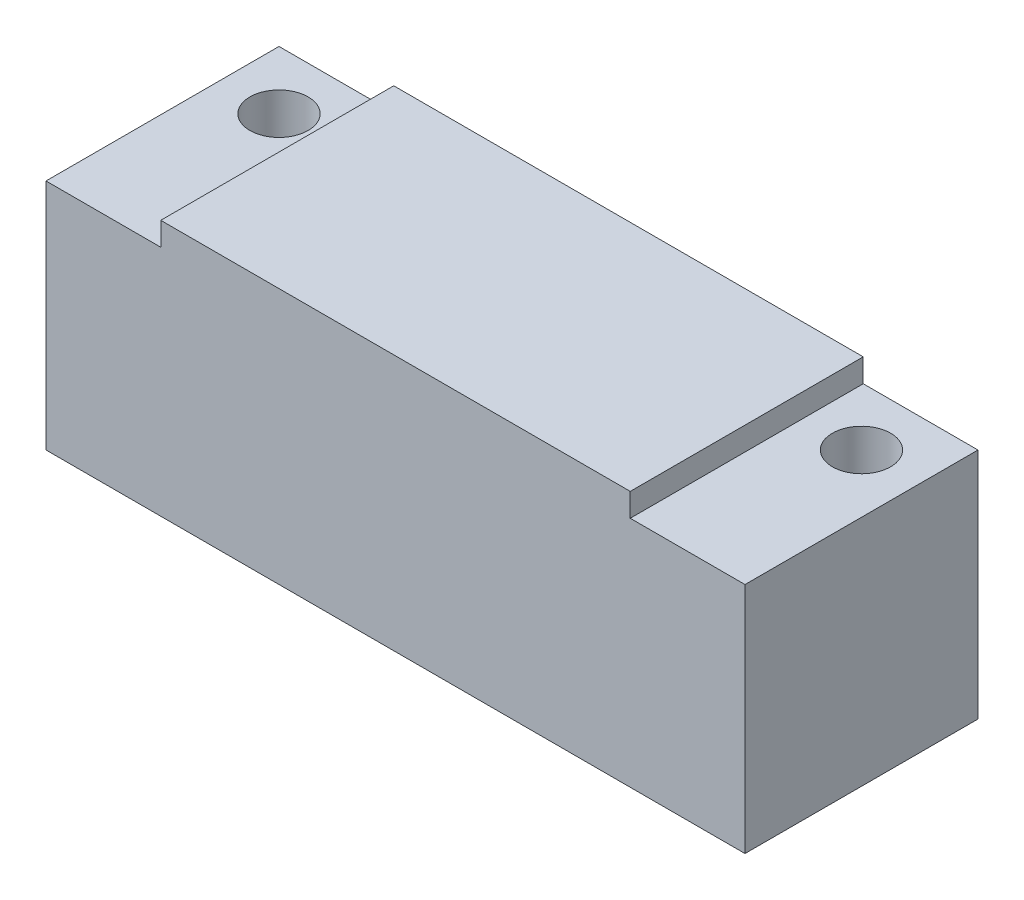
ISO-10303-21;
HEADER;
FILE_DESCRIPTION(('STEP AP214'),'2;1');
FILE_NAME('part.step','',(''),(''),'','','');
FILE_SCHEMA(('AUTOMOTIVE_DESIGN { 1 0 10303 214 1 1 1 1 }'));
ENDSEC;
DATA;
#1=APPLICATION_CONTEXT('core data for automotive mechanical design processes');
#2=APPLICATION_PROTOCOL_DEFINITION('international standard','automotive_design',2000,#1);
#3=PRODUCT_CONTEXT('',#1,'mechanical');
#4=PRODUCT('Part','Part','',(#3));
#5=PRODUCT_RELATED_PRODUCT_CATEGORY('part','',(#4));
#6=PRODUCT_DEFINITION_FORMATION('','',#4);
#7=PRODUCT_DEFINITION_CONTEXT('part definition',#1,'design');
#8=PRODUCT_DEFINITION('design','',#6,#7);
#9=PRODUCT_DEFINITION_SHAPE('','',#8);
#10=(LENGTH_UNIT() NAMED_UNIT(*) SI_UNIT(.MILLI.,.METRE.));
#11=(NAMED_UNIT(*) PLANE_ANGLE_UNIT() SI_UNIT($,.RADIAN.));
#12=(NAMED_UNIT(*) SI_UNIT($,.STERADIAN.) SOLID_ANGLE_UNIT());
#13=UNCERTAINTY_MEASURE_WITH_UNIT(LENGTH_MEASURE(1.E-05),#10,'distance_accuracy_value','');
#14=(GEOMETRIC_REPRESENTATION_CONTEXT(3) GLOBAL_UNCERTAINTY_ASSIGNED_CONTEXT((#13)) GLOBAL_UNIT_ASSIGNED_CONTEXT((#10,
#11,#12)) REPRESENTATION_CONTEXT('',''));
#15=CARTESIAN_POINT('',(0.,0.,0.));
#16=DIRECTION('',(0.,0.,1.));
#17=DIRECTION('',(1.,0.,0.));
#18=AXIS2_PLACEMENT_3D('',#15,#16,#17);
#19=CARTESIAN_POINT('',(0.,0.,20.));
#20=DIRECTION('',(1.,0.,0.));
#21=DIRECTION('',(0.,0.,-1.));
#22=AXIS2_PLACEMENT_3D('',#19,#20,#21);
#23=PLANE('',#22);
#24=DIRECTION('',(0.,-1.,0.));
#25=VECTOR('',#24,1.);
#26=CARTESIAN_POINT('',(0.,0.,0.));
#27=LINE('',#26,#25);
#28=CARTESIAN_POINT('',(0.,20.,0.));
#29=VERTEX_POINT('',#28);
#30=CARTESIAN_POINT('',(0.,0.,0.));
#31=VERTEX_POINT('',#30);
#32=EDGE_CURVE('E148',#29,#31,#27,.T.);
#33=ORIENTED_EDGE('',*,*,#32,.T.);
#34=DIRECTION('',(0.,0.,-1.));
#35=VECTOR('',#34,1.);
#36=CARTESIAN_POINT('',(0.,0.,20.));
#37=LINE('',#36,#35);
#38=CARTESIAN_POINT('',(0.,0.,20.));
#39=VERTEX_POINT('',#38);
#40=EDGE_CURVE('E11',#39,#31,#37,.T.);
#41=ORIENTED_EDGE('',*,*,#40,.F.);
#42=DIRECTION('',(0.,-1.,0.));
#43=VECTOR('',#42,1.);
#44=CARTESIAN_POINT('',(0.,0.,20.));
#45=LINE('',#44,#43);
#46=CARTESIAN_POINT('',(0.,20.,20.));
#47=VERTEX_POINT('',#46);
#48=EDGE_CURVE('E170',#47,#39,#45,.T.);
#49=ORIENTED_EDGE('',*,*,#48,.F.);
#50=DIRECTION('',(0.,0.,-1.));
#51=VECTOR('',#50,1.);
#52=CARTESIAN_POINT('',(0.,20.,20.));
#53=LINE('',#52,#51);
#54=EDGE_CURVE('E144',#47,#29,#53,.T.);
#55=ORIENTED_EDGE('',*,*,#54,.T.);
#56=EDGE_LOOP('',(#33,#41,#49,#55));
#57=FACE_BOUND('',#56,.T.);
#58=ADVANCED_FACE('F45',(#57),#23,.F.);
#59=CARTESIAN_POINT('',(0.,0.,20.));
#60=DIRECTION('',(0.,1.,0.));
#61=DIRECTION('',(0.,0.,1.));
#62=AXIS2_PLACEMENT_3D('',#59,#60,#61);
#63=PLANE('',#62);
#64=CARTESIAN_POINT('',(55.,0.,5.));
#65=DIRECTION('',(0.,-1.,0.));
#66=DIRECTION('',(0.,0.,-1.));
#67=AXIS2_PLACEMENT_3D('',#64,#65,#66);
#68=CIRCLE('',#67,2.5);
#69=CARTESIAN_POINT('',(55.,0.,2.5));
#70=VERTEX_POINT('',#69);
#71=EDGE_CURVE('E190',#70,#70,#68,.T.);
#72=ORIENTED_EDGE('',*,*,#71,.F.);
#73=EDGE_LOOP('',(#72));
#74=FACE_BOUND('',#73,.T.);
#75=CARTESIAN_POINT('',(5.,0.,5.));
#76=DIRECTION('',(0.,-1.,0.));
#77=DIRECTION('',(0.,0.,-1.));
#78=AXIS2_PLACEMENT_3D('',#75,#76,#77);
#79=CIRCLE('',#78,2.5);
#80=CARTESIAN_POINT('',(5.,0.,2.5));
#81=VERTEX_POINT('',#80);
#82=EDGE_CURVE('E197',#81,#81,#79,.T.);
#83=ORIENTED_EDGE('',*,*,#82,.F.);
#84=EDGE_LOOP('',(#83));
#85=FACE_BOUND('',#84,.T.);
#86=DIRECTION('',(1.,0.,0.));
#87=VECTOR('',#86,1.);
#88=CARTESIAN_POINT('',(0.,0.,0.));
#89=LINE('',#88,#87);
#90=CARTESIAN_POINT('',(60.,0.,0.));
#91=VERTEX_POINT('',#90);
#92=EDGE_CURVE('E152',#31,#91,#89,.T.);
#93=ORIENTED_EDGE('',*,*,#92,.T.);
#94=DIRECTION('',(0.,0.,-1.));
#95=VECTOR('',#94,1.);
#96=CARTESIAN_POINT('',(60.,0.,20.));
#97=LINE('',#96,#95);
#98=CARTESIAN_POINT('',(60.,0.,20.));
#99=VERTEX_POINT('',#98);
#100=EDGE_CURVE('E55',#99,#91,#97,.T.);
#101=ORIENTED_EDGE('',*,*,#100,.F.);
#102=DIRECTION('',(1.,0.,0.));
#103=VECTOR('',#102,1.);
#104=CARTESIAN_POINT('',(0.,0.,20.));
#105=LINE('',#104,#103);
#106=EDGE_CURVE('E107',#39,#99,#105,.T.);
#107=ORIENTED_EDGE('',*,*,#106,.F.);
#108=ORIENTED_EDGE('',*,*,#40,.T.);
#109=EDGE_LOOP('',(#93,#101,#107,#108));
#110=FACE_BOUND('',#109,.T.);
#111=ADVANCED_FACE('F245',(#74,#85,#110),#63,.F.);
#112=CARTESIAN_POINT('',(60.,0.,20.));
#113=DIRECTION('',(-1.,0.,0.));
#114=DIRECTION('',(0.,0.,1.));
#115=AXIS2_PLACEMENT_3D('',#112,#113,#114);
#116=PLANE('',#115);
#117=DIRECTION('',(0.,1.,0.));
#118=VECTOR('',#117,1.);
#119=CARTESIAN_POINT('',(60.,0.,0.));
#120=LINE('',#119,#118);
#121=CARTESIAN_POINT('',(60.,20.,0.));
#122=VERTEX_POINT('',#121);
#123=EDGE_CURVE('E155',#91,#122,#120,.T.);
#124=ORIENTED_EDGE('',*,*,#123,.T.);
#125=DIRECTION('',(0.,0.,-1.));
#126=VECTOR('',#125,1.);
#127=CARTESIAN_POINT('',(60.,20.,20.));
#128=LINE('',#127,#126);
#129=CARTESIAN_POINT('',(60.,20.,20.));
#130=VERTEX_POINT('',#129);
#131=EDGE_CURVE('E181',#130,#122,#128,.T.);
#132=ORIENTED_EDGE('',*,*,#131,.F.);
#133=DIRECTION('',(0.,1.,0.));
#134=VECTOR('',#133,1.);
#135=CARTESIAN_POINT('',(60.,0.,20.));
#136=LINE('',#135,#134);
#137=EDGE_CURVE('E209',#99,#130,#136,.T.);
#138=ORIENTED_EDGE('',*,*,#137,.F.);
#139=ORIENTED_EDGE('',*,*,#100,.T.);
#140=EDGE_LOOP('',(#124,#132,#138,#139));
#141=FACE_BOUND('',#140,.T.);
#142=ADVANCED_FACE('F250',(#141),#116,.F.);
#143=CARTESIAN_POINT('',(60.,20.,20.));
#144=DIRECTION('',(0.,-1.,0.));
#145=DIRECTION('',(0.,0.,-1.));
#146=AXIS2_PLACEMENT_3D('',#143,#144,#145);
#147=PLANE('',#146);
#148=CARTESIAN_POINT('',(55.,20.,5.));
#149=DIRECTION('',(0.,-1.,0.));
#150=DIRECTION('',(0.,0.,-1.));
#151=AXIS2_PLACEMENT_3D('',#148,#149,#150);
#152=CIRCLE('',#151,2.5);
#153=CARTESIAN_POINT('',(55.,20.,2.5));
#154=VERTEX_POINT('',#153);
#155=EDGE_CURVE('E48',#154,#154,#152,.T.);
#156=ORIENTED_EDGE('',*,*,#155,.T.);
#157=EDGE_LOOP('',(#156));
#158=FACE_BOUND('',#157,.T.);
#159=DIRECTION('',(-1.,0.,0.));
#160=VECTOR('',#159,1.);
#161=CARTESIAN_POINT('',(60.,20.,0.));
#162=LINE('',#161,#160);
#163=CARTESIAN_POINT('',(50.15,20.,0.));
#164=VERTEX_POINT('',#163);
#165=EDGE_CURVE('E158',#122,#164,#162,.T.);
#166=ORIENTED_EDGE('',*,*,#165,.T.);
#167=DIRECTION('',(0.,0.,-1.));
#168=VECTOR('',#167,1.);
#169=CARTESIAN_POINT('',(50.15,20.,20.));
#170=LINE('',#169,#168);
#171=CARTESIAN_POINT('',(50.15,20.,20.));
#172=VERTEX_POINT('',#171);
#173=EDGE_CURVE('E177',#172,#164,#170,.T.);
#174=ORIENTED_EDGE('',*,*,#173,.F.);
#175=DIRECTION('',(-1.,0.,0.));
#176=VECTOR('',#175,1.);
#177=CARTESIAN_POINT('',(60.,20.,20.));
#178=LINE('',#177,#176);
#179=EDGE_CURVE('E212',#130,#172,#178,.T.);
#180=ORIENTED_EDGE('',*,*,#179,.F.);
#181=ORIENTED_EDGE('',*,*,#131,.T.);
#182=EDGE_LOOP('',(#166,#174,#180,#181));
#183=FACE_BOUND('',#182,.T.);
#184=ADVANCED_FACE('F220',(#158,#183),#147,.F.);
#185=CARTESIAN_POINT('',(50.15,22.,20.));
#186=DIRECTION('',(-1.,0.,0.));
#187=DIRECTION('',(0.,0.,1.));
#188=AXIS2_PLACEMENT_3D('',#185,#186,#187);
#189=PLANE('',#188);
#190=DIRECTION('',(0.,1.,0.));
#191=VECTOR('',#190,1.);
#192=CARTESIAN_POINT('',(50.15,22.,0.));
#193=LINE('',#192,#191);
#194=CARTESIAN_POINT('',(50.15,22.,0.));
#195=VERTEX_POINT('',#194);
#196=EDGE_CURVE('E161',#164,#195,#193,.T.);
#197=ORIENTED_EDGE('',*,*,#196,.T.);
#198=DIRECTION('',(0.,0.,-1.));
#199=VECTOR('',#198,1.);
#200=CARTESIAN_POINT('',(50.15,22.,20.));
#201=LINE('',#200,#199);
#202=CARTESIAN_POINT('',(50.15,22.,20.));
#203=VERTEX_POINT('',#202);
#204=EDGE_CURVE('E137',#203,#195,#201,.T.);
#205=ORIENTED_EDGE('',*,*,#204,.F.);
#206=DIRECTION('',(0.,1.,0.));
#207=VECTOR('',#206,1.);
#208=CARTESIAN_POINT('',(50.15,22.,20.));
#209=LINE('',#208,#207);
#210=EDGE_CURVE('E126',#172,#203,#209,.T.);
#211=ORIENTED_EDGE('',*,*,#210,.F.);
#212=ORIENTED_EDGE('',*,*,#173,.T.);
#213=EDGE_LOOP('',(#197,#205,#211,#212));
#214=FACE_BOUND('',#213,.T.);
#215=ADVANCED_FACE('F224',(#214),#189,.F.);
#216=CARTESIAN_POINT('',(9.85,22.,20.));
#217=DIRECTION('',(0.,-1.,0.));
#218=DIRECTION('',(0.,0.,-1.));
#219=AXIS2_PLACEMENT_3D('',#216,#217,#218);
#220=PLANE('',#219);
#221=DIRECTION('',(-1.,0.,0.));
#222=VECTOR('',#221,1.);
#223=CARTESIAN_POINT('',(9.85,22.,0.));
#224=LINE('',#223,#222);
#225=CARTESIAN_POINT('',(9.85,22.,0.));
#226=VERTEX_POINT('',#225);
#227=EDGE_CURVE('E135',#195,#226,#224,.T.);
#228=ORIENTED_EDGE('',*,*,#227,.T.);
#229=DIRECTION('',(0.,0.,-1.));
#230=VECTOR('',#229,1.);
#231=CARTESIAN_POINT('',(9.85,22.,20.));
#232=LINE('',#231,#230);
#233=CARTESIAN_POINT('',(9.85,22.,20.));
#234=VERTEX_POINT('',#233);
#235=EDGE_CURVE('E132',#234,#226,#232,.T.);
#236=ORIENTED_EDGE('',*,*,#235,.F.);
#237=DIRECTION('',(-1.,0.,0.));
#238=VECTOR('',#237,1.);
#239=CARTESIAN_POINT('',(9.85,22.,20.));
#240=LINE('',#239,#238);
#241=EDGE_CURVE('E120',#203,#234,#240,.T.);
#242=ORIENTED_EDGE('',*,*,#241,.F.);
#243=ORIENTED_EDGE('',*,*,#204,.T.);
#244=EDGE_LOOP('',(#228,#236,#242,#243));
#245=FACE_BOUND('',#244,.T.);
#246=ADVANCED_FACE('F133',(#245),#220,.F.);
#247=CARTESIAN_POINT('',(9.85,22.,20.));
#248=DIRECTION('',(1.,0.,0.));
#249=DIRECTION('',(0.,0.,-1.));
#250=AXIS2_PLACEMENT_3D('',#247,#248,#249);
#251=PLANE('',#250);
#252=DIRECTION('',(0.,-1.,0.));
#253=VECTOR('',#252,1.);
#254=CARTESIAN_POINT('',(9.85,22.,0.));
#255=LINE('',#254,#253);
#256=CARTESIAN_POINT('',(9.85,20.,0.));
#257=VERTEX_POINT('',#256);
#258=EDGE_CURVE('E93',#226,#257,#255,.T.);
#259=ORIENTED_EDGE('',*,*,#258,.T.);
#260=DIRECTION('',(0.,0.,-1.));
#261=VECTOR('',#260,1.);
#262=CARTESIAN_POINT('',(9.85,20.,20.));
#263=LINE('',#262,#261);
#264=CARTESIAN_POINT('',(9.85,20.,20.));
#265=VERTEX_POINT('',#264);
#266=EDGE_CURVE('E138',#265,#257,#263,.T.);
#267=ORIENTED_EDGE('',*,*,#266,.F.);
#268=DIRECTION('',(0.,-1.,0.));
#269=VECTOR('',#268,1.);
#270=CARTESIAN_POINT('',(9.85,22.,20.));
#271=LINE('',#270,#269);
#272=EDGE_CURVE('E124',#234,#265,#271,.T.);
#273=ORIENTED_EDGE('',*,*,#272,.F.);
#274=ORIENTED_EDGE('',*,*,#235,.T.);
#275=EDGE_LOOP('',(#259,#267,#273,#274));
#276=FACE_BOUND('',#275,.T.);
#277=ADVANCED_FACE('F140',(#276),#251,.F.);
#278=CARTESIAN_POINT('',(0.,20.,20.));
#279=DIRECTION('',(0.,-1.,0.));
#280=DIRECTION('',(0.,0.,-1.));
#281=AXIS2_PLACEMENT_3D('',#278,#279,#280);
#282=PLANE('',#281);
#283=CARTESIAN_POINT('',(5.,20.,5.));
#284=DIRECTION('',(0.,-1.,0.));
#285=DIRECTION('',(0.,0.,-1.));
#286=AXIS2_PLACEMENT_3D('',#283,#284,#285);
#287=CIRCLE('',#286,2.5);
#288=CARTESIAN_POINT('',(5.,20.,2.5));
#289=VERTEX_POINT('',#288);
#290=EDGE_CURVE('E187',#289,#289,#287,.T.);
#291=ORIENTED_EDGE('',*,*,#290,.T.);
#292=EDGE_LOOP('',(#291));
#293=FACE_BOUND('',#292,.T.);
#294=DIRECTION('',(-1.,0.,0.));
#295=VECTOR('',#294,1.);
#296=CARTESIAN_POINT('',(0.,20.,0.));
#297=LINE('',#296,#295);
#298=EDGE_CURVE('E99',#257,#29,#297,.T.);
#299=ORIENTED_EDGE('',*,*,#298,.T.);
#300=ORIENTED_EDGE('',*,*,#54,.F.);
#301=DIRECTION('',(-1.,0.,0.));
#302=VECTOR('',#301,1.);
#303=CARTESIAN_POINT('',(0.,20.,20.));
#304=LINE('',#303,#302);
#305=EDGE_CURVE('E64',#265,#47,#304,.T.);
#306=ORIENTED_EDGE('',*,*,#305,.F.);
#307=ORIENTED_EDGE('',*,*,#266,.T.);
#308=EDGE_LOOP('',(#299,#300,#306,#307));
#309=FACE_BOUND('',#308,.T.);
#310=ADVANCED_FACE('F232',(#293,#309),#282,.F.);
#311=CARTESIAN_POINT('',(0.,0.,20.));
#312=DIRECTION('',(0.,0.,-1.));
#313=DIRECTION('',(-1.,0.,0.));
#314=AXIS2_PLACEMENT_3D('',#311,#312,#313);
#315=PLANE('',#314);
#316=ORIENTED_EDGE('',*,*,#48,.T.);
#317=ORIENTED_EDGE('',*,*,#106,.T.);
#318=ORIENTED_EDGE('',*,*,#137,.T.);
#319=ORIENTED_EDGE('',*,*,#179,.T.);
#320=ORIENTED_EDGE('',*,*,#210,.T.);
#321=ORIENTED_EDGE('',*,*,#241,.T.);
#322=ORIENTED_EDGE('',*,*,#272,.T.);
#323=ORIENTED_EDGE('',*,*,#305,.T.);
#324=EDGE_LOOP('',(#316,#317,#318,#319,#320,#321,#322,#323));
#325=FACE_BOUND('',#324,.T.);
#326=ADVANCED_FACE('F122',(#325),#315,.F.);
#327=CARTESIAN_POINT('',(0.,0.,0.));
#328=DIRECTION('',(0.,0.,-1.));
#329=DIRECTION('',(-1.,0.,0.));
#330=AXIS2_PLACEMENT_3D('',#327,#328,#329);
#331=PLANE('',#330);
#332=ORIENTED_EDGE('',*,*,#32,.F.);
#333=ORIENTED_EDGE('',*,*,#298,.F.);
#334=ORIENTED_EDGE('',*,*,#258,.F.);
#335=ORIENTED_EDGE('',*,*,#227,.F.);
#336=ORIENTED_EDGE('',*,*,#196,.F.);
#337=ORIENTED_EDGE('',*,*,#165,.F.);
#338=ORIENTED_EDGE('',*,*,#123,.F.);
#339=ORIENTED_EDGE('',*,*,#92,.F.);
#340=EDGE_LOOP('',(#332,#333,#334,#335,#336,#337,#338,#339));
#341=FACE_BOUND('',#340,.T.);
#342=ADVANCED_FACE('F227',(#341),#331,.T.);
#343=CARTESIAN_POINT('',(5.,22.,5.));
#344=DIRECTION('',(0.,-1.,0.));
#345=DIRECTION('',(0.,0.,-1.));
#346=AXIS2_PLACEMENT_3D('',#343,#344,#345);
#347=CYLINDRICAL_SURFACE('',#346,2.5);
#348=ORIENTED_EDGE('',*,*,#82,.T.);
#349=EDGE_LOOP('',(#348));
#350=FACE_BOUND('',#349,.T.);
#351=ORIENTED_EDGE('',*,*,#290,.F.);
#352=EDGE_LOOP('',(#351));
#353=FACE_BOUND('',#352,.T.);
#354=ADVANCED_FACE('F283',(#350,#353),#347,.F.);
#355=CARTESIAN_POINT('',(55.,22.,5.));
#356=DIRECTION('',(0.,-1.,0.));
#357=DIRECTION('',(0.,0.,-1.));
#358=AXIS2_PLACEMENT_3D('',#355,#356,#357);
#359=CYLINDRICAL_SURFACE('',#358,2.5);
#360=ORIENTED_EDGE('',*,*,#71,.T.);
#361=EDGE_LOOP('',(#360));
#362=FACE_BOUND('',#361,.T.);
#363=ORIENTED_EDGE('',*,*,#155,.F.);
#364=EDGE_LOOP('',(#363));
#365=FACE_BOUND('',#364,.T.);
#366=ADVANCED_FACE('F293',(#362,#365),#359,.F.);
#367=CLOSED_SHELL('',(#58,#111,#142,#184,#215,#246,#277,#310,#326,#342,#354,#366));
#368=MANIFOLD_SOLID_BREP('B2',#367);
#369=ADVANCED_BREP_SHAPE_REPRESENTATION('',(#18,#368),#14);
#370=SHAPE_DEFINITION_REPRESENTATION(#9,#369);
ENDSEC;
END-ISO-10303-21;
